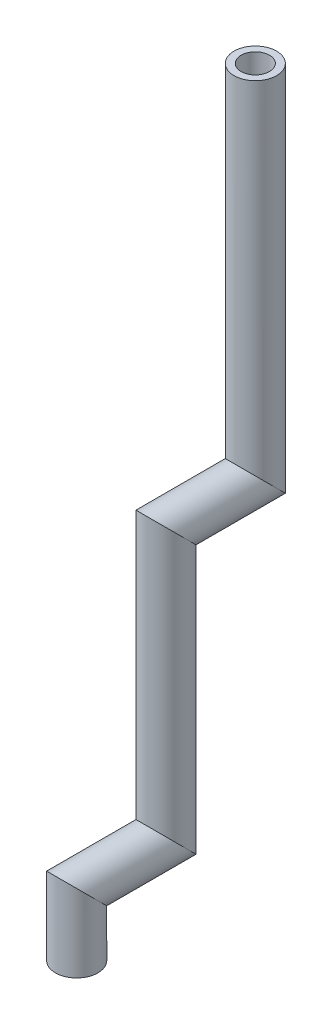
ISO-10303-21;
HEADER;
FILE_DESCRIPTION(('STEP AP214'),'2;1');
FILE_NAME('part.step','',(''),(''),'','','');
FILE_SCHEMA(('AUTOMOTIVE_DESIGN { 1 0 10303 214 1 1 1 1 }'));
ENDSEC;
DATA;
#1=APPLICATION_CONTEXT('core data for automotive mechanical design processes');
#2=APPLICATION_PROTOCOL_DEFINITION('international standard','automotive_design',2000,#1);
#3=PRODUCT_CONTEXT('',#1,'mechanical');
#4=PRODUCT('Part','Part','',(#3));
#5=PRODUCT_RELATED_PRODUCT_CATEGORY('part','',(#4));
#6=PRODUCT_DEFINITION_FORMATION('','',#4);
#7=PRODUCT_DEFINITION_CONTEXT('part definition',#1,'design');
#8=PRODUCT_DEFINITION('design','',#6,#7);
#9=PRODUCT_DEFINITION_SHAPE('','',#8);
#10=(LENGTH_UNIT() NAMED_UNIT(*) SI_UNIT(.MILLI.,.METRE.));
#11=(NAMED_UNIT(*) PLANE_ANGLE_UNIT() SI_UNIT($,.RADIAN.));
#12=(NAMED_UNIT(*) SI_UNIT($,.STERADIAN.) SOLID_ANGLE_UNIT());
#13=UNCERTAINTY_MEASURE_WITH_UNIT(LENGTH_MEASURE(1.E-05),#10,'distance_accuracy_value','');
#14=(GEOMETRIC_REPRESENTATION_CONTEXT(3) GLOBAL_UNCERTAINTY_ASSIGNED_CONTEXT((#13)) GLOBAL_UNIT_ASSIGNED_CONTEXT((#10,
#11,#12)) REPRESENTATION_CONTEXT('',''));
#15=CARTESIAN_POINT('',(0.,0.,0.));
#16=DIRECTION('',(0.,0.,1.));
#17=DIRECTION('',(1.,0.,0.));
#18=AXIS2_PLACEMENT_3D('',#15,#16,#17);
#19=CARTESIAN_POINT('',(0.,68.66125,-48.));
#20=DIRECTION('',(0.,1.,0.));
#21=DIRECTION('',(0.,0.,1.));
#22=AXIS2_PLACEMENT_3D('',#19,#20,#21);
#23=CYLINDRICAL_SURFACE('',#22,4.7625);
#24=CARTESIAN_POINT('',(0.,74.,-48.));
#25=DIRECTION('',(0.,0.707106781186548,-0.707106781186548));
#26=DIRECTION('',(0.,-0.707106781186548,-0.707106781186548));
#27=AXIS2_PLACEMENT_3D('',#24,#25,#26);
#28=ELLIPSE('',#27,6.73519209080187,4.7625);
#29=CARTESIAN_POINT('',(0.,69.2375,-52.7625));
#30=VERTEX_POINT('',#29);
#31=EDGE_CURVE('E46',#30,#30,#28,.F.);
#32=ORIENTED_EDGE('',*,*,#31,.F.);
#33=EDGE_LOOP('',(#32));
#34=FACE_BOUND('',#33,.T.);
#35=CARTESIAN_POINT('',(0.,154.,-48.));
#36=DIRECTION('',(0.,1.,0.));
#37=DIRECTION('',(0.,0.,1.));
#38=AXIS2_PLACEMENT_3D('',#35,#36,#37);
#39=CIRCLE('',#38,4.7625);
#40=CARTESIAN_POINT('',(0.,154.,-43.2375));
#41=VERTEX_POINT('',#40);
#42=EDGE_CURVE('E79',#41,#41,#39,.T.);
#43=ORIENTED_EDGE('',*,*,#42,.F.);
#44=EDGE_LOOP('',(#43));
#45=FACE_BOUND('',#44,.T.);
#46=ADVANCED_FACE('F43',(#34,#45),#23,.T.);
#47=CARTESIAN_POINT('',(0.,74.,-22.66125));
#48=DIRECTION('',(0.,0.,-1.));
#49=DIRECTION('',(-1.,0.,0.));
#50=AXIS2_PLACEMENT_3D('',#47,#48,#49);
#51=CYLINDRICAL_SURFACE('',#50,4.7625);
#52=CARTESIAN_POINT('',(0.,74.,-28.));
#53=DIRECTION('',(0.,0.707106781186548,-0.707106781186548));
#54=DIRECTION('',(0.,0.707106781186548,0.707106781186548));
#55=AXIS2_PLACEMENT_3D('',#52,#53,#54);
#56=ELLIPSE('',#55,6.73519209080187,4.7625);
#57=CARTESIAN_POINT('',(0.,78.7625,-23.2375));
#58=VERTEX_POINT('',#57);
#59=EDGE_CURVE('E90',#58,#58,#56,.F.);
#60=ORIENTED_EDGE('',*,*,#59,.F.);
#61=EDGE_LOOP('',(#60));
#62=FACE_BOUND('',#61,.T.);
#63=ORIENTED_EDGE('',*,*,#31,.T.);
#64=EDGE_LOOP('',(#63));
#65=FACE_BOUND('',#64,.T.);
#66=ADVANCED_FACE('F99',(#62,#65),#51,.T.);
#67=CARTESIAN_POINT('',(0.,8.66125,-28.));
#68=DIRECTION('',(0.,1.,0.));
#69=DIRECTION('',(0.,0.,1.));
#70=AXIS2_PLACEMENT_3D('',#67,#68,#69);
#71=CYLINDRICAL_SURFACE('',#70,4.7625);
#72=CARTESIAN_POINT('',(0.,14.,-28.));
#73=DIRECTION('',(0.,0.707106781186547,-0.707106781186547));
#74=DIRECTION('',(0.,-0.707106781186548,-0.707106781186548));
#75=AXIS2_PLACEMENT_3D('',#72,#73,#74);
#76=ELLIPSE('',#75,6.73519209080187,4.7625);
#77=CARTESIAN_POINT('',(0.,9.2375,-32.7625));
#78=VERTEX_POINT('',#77);
#79=EDGE_CURVE('E87',#78,#78,#76,.F.);
#80=ORIENTED_EDGE('',*,*,#79,.F.);
#81=EDGE_LOOP('',(#80));
#82=FACE_BOUND('',#81,.T.);
#83=ORIENTED_EDGE('',*,*,#59,.T.);
#84=EDGE_LOOP('',(#83));
#85=FACE_BOUND('',#84,.T.);
#86=ADVANCED_FACE('F194',(#82,#85),#71,.T.);
#87=CARTESIAN_POINT('',(0.,14.,-2.66125));
#88=DIRECTION('',(0.,0.,-1.));
#89=DIRECTION('',(-1.,0.,0.));
#90=AXIS2_PLACEMENT_3D('',#87,#88,#89);
#91=CYLINDRICAL_SURFACE('',#90,4.7625);
#92=CARTESIAN_POINT('',(0.,14.,-8.));
#93=DIRECTION('',(0.,0.707106781186547,-0.707106781186547));
#94=DIRECTION('',(0.,0.707106781186548,0.707106781186548));
#95=AXIS2_PLACEMENT_3D('',#92,#93,#94);
#96=ELLIPSE('',#95,6.73519209080187,4.7625);
#97=CARTESIAN_POINT('',(0.,18.7625,-3.2375));
#98=VERTEX_POINT('',#97);
#99=EDGE_CURVE('E83',#98,#98,#96,.F.);
#100=ORIENTED_EDGE('',*,*,#99,.F.);
#101=EDGE_LOOP('',(#100));
#102=FACE_BOUND('',#101,.T.);
#103=ORIENTED_EDGE('',*,*,#79,.T.);
#104=EDGE_LOOP('',(#103));
#105=FACE_BOUND('',#104,.T.);
#106=ADVANCED_FACE('F118',(#102,#105),#91,.T.);
#107=CARTESIAN_POINT('',(0.,0.,-8.));
#108=DIRECTION('',(0.,1.,0.));
#109=DIRECTION('',(0.,0.,1.));
#110=AXIS2_PLACEMENT_3D('',#107,#108,#109);
#111=CYLINDRICAL_SURFACE('',#110,4.7625);
#112=CARTESIAN_POINT('',(0.,0.,-8.));
#113=DIRECTION('',(0.,1.,0.));
#114=DIRECTION('',(0.,0.,1.));
#115=AXIS2_PLACEMENT_3D('',#112,#113,#114);
#116=CIRCLE('',#115,4.7625);
#117=CARTESIAN_POINT('',(0.,0.,-3.2375));
#118=VERTEX_POINT('',#117);
#119=EDGE_CURVE('E75',#118,#118,#116,.T.);
#120=ORIENTED_EDGE('',*,*,#119,.T.);
#121=EDGE_LOOP('',(#120));
#122=FACE_BOUND('',#121,.T.);
#123=ORIENTED_EDGE('',*,*,#99,.T.);
#124=EDGE_LOOP('',(#123));
#125=FACE_BOUND('',#124,.T.);
#126=ADVANCED_FACE('F108',(#122,#125),#111,.T.);
#127=CARTESIAN_POINT('',(0.,154.,-48.));
#128=DIRECTION('',(0.,1.,0.));
#129=DIRECTION('',(0.,0.,1.));
#130=AXIS2_PLACEMENT_3D('',#127,#128,#129);
#131=PLANE('',#130);
#132=CARTESIAN_POINT('',(0.,154.,-48.));
#133=DIRECTION('',(0.,1.,0.));
#134=DIRECTION('',(0.,0.,1.));
#135=AXIS2_PLACEMENT_3D('',#132,#133,#134);
#136=CIRCLE('',#135,3.175);
#137=CARTESIAN_POINT('',(0.,154.,-44.825));
#138=VERTEX_POINT('',#137);
#139=EDGE_CURVE('E71',#138,#138,#136,.F.);
#140=ORIENTED_EDGE('',*,*,#139,.T.);
#141=EDGE_LOOP('',(#140));
#142=FACE_BOUND('',#141,.T.);
#143=ORIENTED_EDGE('',*,*,#42,.T.);
#144=EDGE_LOOP('',(#143));
#145=FACE_BOUND('',#144,.T.);
#146=ADVANCED_FACE('F105',(#142,#145),#131,.T.);
#147=CARTESIAN_POINT('',(0.,0.,-8.));
#148=DIRECTION('',(0.,1.,0.));
#149=DIRECTION('',(0.,0.,1.));
#150=AXIS2_PLACEMENT_3D('',#147,#148,#149);
#151=PLANE('',#150);
#152=CARTESIAN_POINT('',(0.,0.,-8.));
#153=DIRECTION('',(0.,1.,0.));
#154=DIRECTION('',(0.,0.,1.));
#155=AXIS2_PLACEMENT_3D('',#152,#153,#154);
#156=CIRCLE('',#155,3.175);
#157=CARTESIAN_POINT('',(0.,0.,-4.825));
#158=VERTEX_POINT('',#157);
#159=EDGE_CURVE('E51',#158,#158,#156,.F.);
#160=ORIENTED_EDGE('',*,*,#159,.F.);
#161=EDGE_LOOP('',(#160));
#162=FACE_BOUND('',#161,.T.);
#163=ORIENTED_EDGE('',*,*,#119,.F.);
#164=EDGE_LOOP('',(#163));
#165=FACE_BOUND('',#164,.T.);
#166=ADVANCED_FACE('F107',(#162,#165),#151,.F.);
#167=CARTESIAN_POINT('',(0.,70.4075,-48.));
#168=DIRECTION('',(0.,1.,0.));
#169=DIRECTION('',(0.,0.,1.));
#170=AXIS2_PLACEMENT_3D('',#167,#168,#169);
#171=CYLINDRICAL_SURFACE('',#170,3.175);
#172=CARTESIAN_POINT('',(0.,74.,-48.));
#173=DIRECTION('',(0.,0.707106781186547,-0.707106781186547));
#174=DIRECTION('',(0.,-0.707106781186548,-0.707106781186548));
#175=AXIS2_PLACEMENT_3D('',#172,#173,#174);
#176=ELLIPSE('',#175,4.49012806053458,3.175);
#177=CARTESIAN_POINT('',(0.,70.825,-51.175));
#178=VERTEX_POINT('',#177);
#179=EDGE_CURVE('E67',#178,#178,#176,.T.);
#180=ORIENTED_EDGE('',*,*,#179,.F.);
#181=EDGE_LOOP('',(#180));
#182=FACE_BOUND('',#181,.T.);
#183=ORIENTED_EDGE('',*,*,#139,.F.);
#184=EDGE_LOOP('',(#183));
#185=FACE_BOUND('',#184,.T.);
#186=ADVANCED_FACE('F115',(#182,#185),#171,.F.);
#187=CARTESIAN_POINT('',(0.,74.,-24.4075));
#188=DIRECTION('',(0.,0.,-1.));
#189=DIRECTION('',(-1.,0.,0.));
#190=AXIS2_PLACEMENT_3D('',#187,#188,#189);
#191=CYLINDRICAL_SURFACE('',#190,3.175);
#192=CARTESIAN_POINT('',(0.,74.,-28.));
#193=DIRECTION('',(0.,0.707106781186548,-0.707106781186548));
#194=DIRECTION('',(0.,0.707106781186548,0.707106781186548));
#195=AXIS2_PLACEMENT_3D('',#192,#193,#194);
#196=ELLIPSE('',#195,4.49012806053458,3.175);
#197=CARTESIAN_POINT('',(0.,77.175,-24.825));
#198=VERTEX_POINT('',#197);
#199=EDGE_CURVE('E63',#198,#198,#196,.T.);
#200=ORIENTED_EDGE('',*,*,#199,.F.);
#201=EDGE_LOOP('',(#200));
#202=FACE_BOUND('',#201,.T.);
#203=ORIENTED_EDGE('',*,*,#179,.T.);
#204=EDGE_LOOP('',(#203));
#205=FACE_BOUND('',#204,.T.);
#206=ADVANCED_FACE('F135',(#202,#205),#191,.F.);
#207=CARTESIAN_POINT('',(0.,10.4075,-28.));
#208=DIRECTION('',(0.,1.,0.));
#209=DIRECTION('',(0.,0.,1.));
#210=AXIS2_PLACEMENT_3D('',#207,#208,#209);
#211=CYLINDRICAL_SURFACE('',#210,3.175);
#212=CARTESIAN_POINT('',(0.,14.,-28.));
#213=DIRECTION('',(0.,0.707106781186548,-0.707106781186548));
#214=DIRECTION('',(0.,-0.707106781186548,-0.707106781186548));
#215=AXIS2_PLACEMENT_3D('',#212,#213,#214);
#216=ELLIPSE('',#215,4.49012806053458,3.175);
#217=CARTESIAN_POINT('',(0.,10.825,-31.175));
#218=VERTEX_POINT('',#217);
#219=EDGE_CURVE('E57',#218,#218,#216,.T.);
#220=ORIENTED_EDGE('',*,*,#219,.F.);
#221=EDGE_LOOP('',(#220));
#222=FACE_BOUND('',#221,.T.);
#223=ORIENTED_EDGE('',*,*,#199,.T.);
#224=EDGE_LOOP('',(#223));
#225=FACE_BOUND('',#224,.T.);
#226=ADVANCED_FACE('F129',(#222,#225),#211,.F.);
#227=CARTESIAN_POINT('',(0.,14.,-4.4075));
#228=DIRECTION('',(0.,0.,-1.));
#229=DIRECTION('',(-1.,0.,0.));
#230=AXIS2_PLACEMENT_3D('',#227,#228,#229);
#231=CYLINDRICAL_SURFACE('',#230,3.175);
#232=CARTESIAN_POINT('',(0.,14.,-8.));
#233=DIRECTION('',(0.,0.707106781186548,-0.707106781186548));
#234=DIRECTION('',(0.,0.707106781186548,0.707106781186548));
#235=AXIS2_PLACEMENT_3D('',#232,#233,#234);
#236=ELLIPSE('',#235,4.49012806053458,3.175);
#237=CARTESIAN_POINT('',(0.,17.175,-4.825));
#238=VERTEX_POINT('',#237);
#239=EDGE_CURVE('E10',#238,#238,#236,.T.);
#240=ORIENTED_EDGE('',*,*,#239,.F.);
#241=EDGE_LOOP('',(#240));
#242=FACE_BOUND('',#241,.T.);
#243=ORIENTED_EDGE('',*,*,#219,.T.);
#244=EDGE_LOOP('',(#243));
#245=FACE_BOUND('',#244,.T.);
#246=ADVANCED_FACE('F123',(#242,#245),#231,.F.);
#247=CARTESIAN_POINT('',(0.,0.,-8.));
#248=DIRECTION('',(0.,1.,0.));
#249=DIRECTION('',(0.,0.,1.));
#250=AXIS2_PLACEMENT_3D('',#247,#248,#249);
#251=CYLINDRICAL_SURFACE('',#250,3.175);
#252=ORIENTED_EDGE('',*,*,#159,.T.);
#253=EDGE_LOOP('',(#252));
#254=FACE_BOUND('',#253,.T.);
#255=ORIENTED_EDGE('',*,*,#239,.T.);
#256=EDGE_LOOP('',(#255));
#257=FACE_BOUND('',#256,.T.);
#258=ADVANCED_FACE('F121',(#254,#257),#251,.F.);
#259=CLOSED_SHELL('',(#46,#66,#86,#106,#126,#146,#166,#186,#206,#226,#246,#258));
#260=MANIFOLD_SOLID_BREP('B2',#259);
#261=ADVANCED_BREP_SHAPE_REPRESENTATION('',(#18,#260),#14);
#262=SHAPE_DEFINITION_REPRESENTATION(#9,#261);
ENDSEC;
END-ISO-10303-21;
